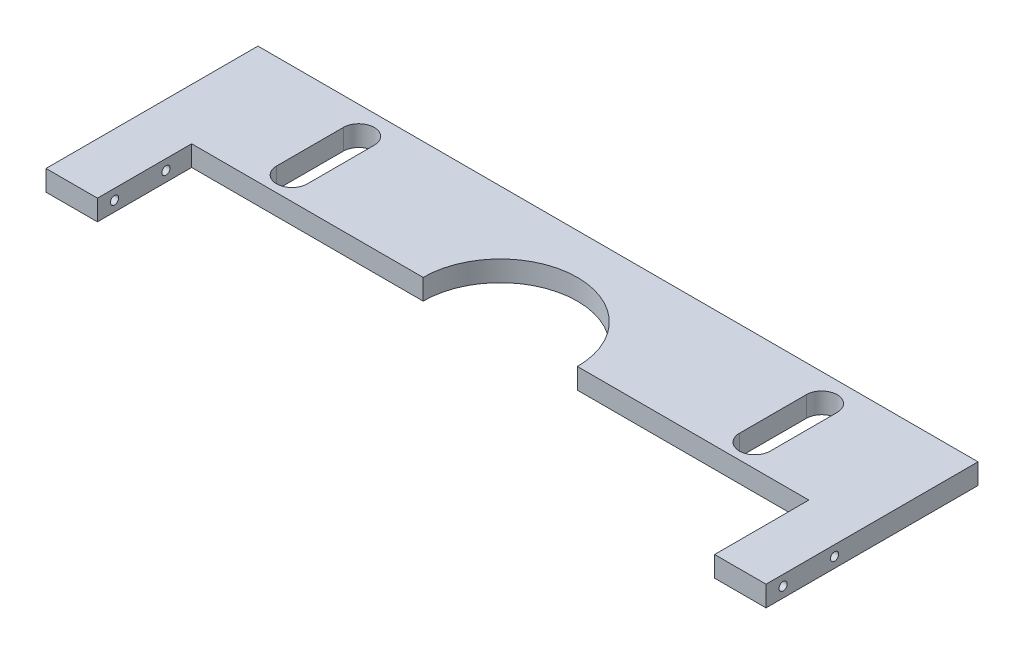
ISO-10303-21;
HEADER;
FILE_DESCRIPTION(('STEP AP214'),'2;1');
FILE_NAME('part.step','',(''),(''),'','','');
FILE_SCHEMA(('AUTOMOTIVE_DESIGN { 1 0 10303 214 1 1 1 1 }'));
ENDSEC;
DATA;
#1=APPLICATION_CONTEXT('core data for automotive mechanical design processes');
#2=APPLICATION_PROTOCOL_DEFINITION('international standard','automotive_design',2000,#1);
#3=PRODUCT_CONTEXT('',#1,'mechanical');
#4=PRODUCT('Part','Part','',(#3));
#5=PRODUCT_RELATED_PRODUCT_CATEGORY('part','',(#4));
#6=PRODUCT_DEFINITION_FORMATION('','',#4);
#7=PRODUCT_DEFINITION_CONTEXT('part definition',#1,'design');
#8=PRODUCT_DEFINITION('design','',#6,#7);
#9=PRODUCT_DEFINITION_SHAPE('','',#8);
#10=(LENGTH_UNIT() NAMED_UNIT(*) SI_UNIT(.MILLI.,.METRE.));
#11=(NAMED_UNIT(*) PLANE_ANGLE_UNIT() SI_UNIT($,.RADIAN.));
#12=(NAMED_UNIT(*) SI_UNIT($,.STERADIAN.) SOLID_ANGLE_UNIT());
#13=UNCERTAINTY_MEASURE_WITH_UNIT(LENGTH_MEASURE(1.E-05),#10,'distance_accuracy_value','');
#14=(GEOMETRIC_REPRESENTATION_CONTEXT(3) GLOBAL_UNCERTAINTY_ASSIGNED_CONTEXT((#13)) GLOBAL_UNIT_ASSIGNED_CONTEXT((#10,
#11,#12)) REPRESENTATION_CONTEXT('',''));
#15=CARTESIAN_POINT('',(0.,0.,0.));
#16=DIRECTION('',(0.,0.,1.));
#17=DIRECTION('',(1.,0.,0.));
#18=AXIS2_PLACEMENT_3D('',#15,#16,#17);
#19=CARTESIAN_POINT('',(-60.,0.,-0.555000000000003));
#20=DIRECTION('',(0.,0.,-1.));
#21=DIRECTION('',(-1.,0.,0.));
#22=AXIS2_PLACEMENT_3D('',#19,#20,#21);
#23=PLANE('',#22);
#24=DIRECTION('',(-1.,0.,0.));
#25=VECTOR('',#24,1.);
#26=CARTESIAN_POINT('',(-60.,0.,-0.555000000000003));
#27=LINE('',#26,#25);
#28=CARTESIAN_POINT('',(-15.,0.,-0.555000000000011));
#29=VERTEX_POINT('',#28);
#30=CARTESIAN_POINT('',(-60.,0.,-0.555000000000003));
#31=VERTEX_POINT('',#30);
#32=EDGE_CURVE('E171',#29,#31,#27,.T.);
#33=ORIENTED_EDGE('',*,*,#32,.F.);
#34=DIRECTION('',(0.,1.,0.));
#35=VECTOR('',#34,1.);
#36=CARTESIAN_POINT('',(-15.,-6.,-0.555000000000003));
#37=LINE('',#36,#35);
#38=CARTESIAN_POINT('',(-15.,4.,-0.555000000000011));
#39=VERTEX_POINT('',#38);
#40=EDGE_CURVE('E11',#29,#39,#37,.T.);
#41=ORIENTED_EDGE('',*,*,#40,.T.);
#42=DIRECTION('',(-1.,0.,0.));
#43=VECTOR('',#42,1.);
#44=CARTESIAN_POINT('',(-60.,4.,-0.555000000000003));
#45=LINE('',#44,#43);
#46=CARTESIAN_POINT('',(-60.,4.,-0.555000000000003));
#47=VERTEX_POINT('',#46);
#48=EDGE_CURVE('E169',#39,#47,#45,.T.);
#49=ORIENTED_EDGE('',*,*,#48,.T.);
#50=DIRECTION('',(0.,1.,0.));
#51=VECTOR('',#50,1.);
#52=CARTESIAN_POINT('',(-60.,0.,-0.555000000000003));
#53=LINE('',#52,#51);
#54=EDGE_CURVE('E184',#31,#47,#53,.T.);
#55=ORIENTED_EDGE('',*,*,#54,.F.);
#56=EDGE_LOOP('',(#33,#41,#49,#55));
#57=FACE_BOUND('',#56,.T.);
#58=ADVANCED_FACE('F36',(#57),#23,.F.);
#59=CARTESIAN_POINT('',(70.,4.,19.445));
#60=DIRECTION('',(-1.,0.,0.));
#61=DIRECTION('',(0.,0.,1.));
#62=AXIS2_PLACEMENT_3D('',#59,#60,#61);
#63=PLANE('',#62);
#64=CARTESIAN_POINT('',(70.,2.,4.445));
#65=DIRECTION('',(1.,0.,0.));
#66=DIRECTION('',(0.,0.,-1.));
#67=AXIS2_PLACEMENT_3D('',#64,#65,#66);
#68=CIRCLE('',#67,0.799999999999998);
#69=CARTESIAN_POINT('',(70.,2.,3.645));
#70=VERTEX_POINT('',#69);
#71=EDGE_CURVE('E198',#70,#70,#68,.T.);
#72=ORIENTED_EDGE('',*,*,#71,.F.);
#73=EDGE_LOOP('',(#72));
#74=FACE_BOUND('',#73,.T.);
#75=CARTESIAN_POINT('',(70.,2.,14.445));
#76=DIRECTION('',(1.,0.,0.));
#77=DIRECTION('',(0.,0.,-1.));
#78=AXIS2_PLACEMENT_3D('',#75,#76,#77);
#79=CIRCLE('',#78,0.799999999999998);
#80=CARTESIAN_POINT('',(70.,2.,13.645));
#81=VERTEX_POINT('',#80);
#82=EDGE_CURVE('E201',#81,#81,#79,.T.);
#83=ORIENTED_EDGE('',*,*,#82,.F.);
#84=EDGE_LOOP('',(#83));
#85=FACE_BOUND('',#84,.T.);
#86=DIRECTION('',(0.,0.,-1.));
#87=VECTOR('',#86,1.);
#88=CARTESIAN_POINT('',(70.,4.,19.445));
#89=LINE('',#88,#87);
#90=CARTESIAN_POINT('',(70.,4.,17.765));
#91=VERTEX_POINT('',#90);
#92=CARTESIAN_POINT('',(70.,4.,-23.445));
#93=VERTEX_POINT('',#92);
#94=EDGE_CURVE('E211',#91,#93,#89,.T.);
#95=ORIENTED_EDGE('',*,*,#94,.F.);
#96=DIRECTION('',(0.,1.,0.));
#97=VECTOR('',#96,1.);
#98=CARTESIAN_POINT('',(70.,-6.,17.765));
#99=LINE('',#98,#97);
#100=CARTESIAN_POINT('',(70.,0.,17.765));
#101=VERTEX_POINT('',#100);
#102=EDGE_CURVE('E280',#101,#91,#99,.T.);
#103=ORIENTED_EDGE('',*,*,#102,.F.);
#104=DIRECTION('',(0.,0.,-1.));
#105=VECTOR('',#104,1.);
#106=CARTESIAN_POINT('',(70.,0.,19.445));
#107=LINE('',#106,#105);
#108=CARTESIAN_POINT('',(70.,0.,-23.445));
#109=VERTEX_POINT('',#108);
#110=EDGE_CURVE('E210',#101,#109,#107,.T.);
#111=ORIENTED_EDGE('',*,*,#110,.T.);
#112=DIRECTION('',(0.,1.,0.));
#113=VECTOR('',#112,1.);
#114=CARTESIAN_POINT('',(70.,0.,-23.445));
#115=LINE('',#114,#113);
#116=EDGE_CURVE('E244',#109,#93,#115,.T.);
#117=ORIENTED_EDGE('',*,*,#116,.T.);
#118=EDGE_LOOP('',(#95,#103,#111,#117));
#119=FACE_BOUND('',#118,.T.);
#120=ADVANCED_FACE('F38',(#74,#85,#119),#63,.F.);
#121=CARTESIAN_POINT('',(-70.,4.,19.445));
#122=DIRECTION('',(1.,0.,0.));
#123=DIRECTION('',(0.,0.,-1.));
#124=AXIS2_PLACEMENT_3D('',#121,#122,#123);
#125=PLANE('',#124);
#126=CARTESIAN_POINT('',(-70.,2.,4.445));
#127=DIRECTION('',(-1.,0.,0.));
#128=DIRECTION('',(0.,0.,1.));
#129=AXIS2_PLACEMENT_3D('',#126,#127,#128);
#130=CIRCLE('',#129,0.799999999999998);
#131=CARTESIAN_POINT('',(-70.,2.,5.24499999999999));
#132=VERTEX_POINT('',#131);
#133=EDGE_CURVE('E204',#132,#132,#130,.T.);
#134=ORIENTED_EDGE('',*,*,#133,.F.);
#135=EDGE_LOOP('',(#134));
#136=FACE_BOUND('',#135,.T.);
#137=CARTESIAN_POINT('',(-70.,2.,14.445));
#138=DIRECTION('',(-1.,0.,0.));
#139=DIRECTION('',(0.,0.,1.));
#140=AXIS2_PLACEMENT_3D('',#137,#138,#139);
#141=CIRCLE('',#140,0.799999999999998);
#142=CARTESIAN_POINT('',(-70.,2.,15.245));
#143=VERTEX_POINT('',#142);
#144=EDGE_CURVE('E207',#143,#143,#141,.T.);
#145=ORIENTED_EDGE('',*,*,#144,.F.);
#146=EDGE_LOOP('',(#145));
#147=FACE_BOUND('',#146,.T.);
#148=DIRECTION('',(0.,0.,1.));
#149=VECTOR('',#148,1.);
#150=CARTESIAN_POINT('',(-70.,0.,19.445));
#151=LINE('',#150,#149);
#152=CARTESIAN_POINT('',(-70.,0.,-23.445));
#153=VERTEX_POINT('',#152);
#154=CARTESIAN_POINT('',(-70.,0.,17.765));
#155=VERTEX_POINT('',#154);
#156=EDGE_CURVE('E214',#153,#155,#151,.T.);
#157=ORIENTED_EDGE('',*,*,#156,.T.);
#158=DIRECTION('',(0.,1.,0.));
#159=VECTOR('',#158,1.);
#160=CARTESIAN_POINT('',(-70.,-6.,17.765));
#161=LINE('',#160,#159);
#162=CARTESIAN_POINT('',(-70.,4.,17.765));
#163=VERTEX_POINT('',#162);
#164=EDGE_CURVE('E268',#155,#163,#161,.T.);
#165=ORIENTED_EDGE('',*,*,#164,.T.);
#166=DIRECTION('',(0.,0.,1.));
#167=VECTOR('',#166,1.);
#168=CARTESIAN_POINT('',(-70.,4.,19.445));
#169=LINE('',#168,#167);
#170=CARTESIAN_POINT('',(-70.,4.,-23.445));
#171=VERTEX_POINT('',#170);
#172=EDGE_CURVE('E213',#171,#163,#169,.T.);
#173=ORIENTED_EDGE('',*,*,#172,.F.);
#174=DIRECTION('',(0.,1.,0.));
#175=VECTOR('',#174,1.);
#176=CARTESIAN_POINT('',(-70.,0.,-23.445));
#177=LINE('',#176,#175);
#178=EDGE_CURVE('E240',#153,#171,#177,.T.);
#179=ORIENTED_EDGE('',*,*,#178,.F.);
#180=EDGE_LOOP('',(#157,#165,#173,#179));
#181=FACE_BOUND('',#180,.T.);
#182=ADVANCED_FACE('F279',(#136,#147,#181),#125,.F.);
#183=CARTESIAN_POINT('',(0.,4.,0.));
#184=DIRECTION('',(0.,-1.,0.));
#185=DIRECTION('',(0.,0.,-1.));
#186=AXIS2_PLACEMENT_3D('',#183,#184,#185);
#187=PLANE('',#186);
#188=DIRECTION('',(0.,0.,1.));
#189=VECTOR('',#188,1.);
#190=CARTESIAN_POINT('',(42.,4.,-18.055));
#191=LINE('',#190,#189);
#192=CARTESIAN_POINT('',(42.,4.,-18.055));
#193=VERTEX_POINT('',#192);
#194=CARTESIAN_POINT('',(42.,4.,-5.055));
#195=VERTEX_POINT('',#194);
#196=EDGE_CURVE('E334',#193,#195,#191,.T.);
#197=ORIENTED_EDGE('',*,*,#196,.F.);
#198=CARTESIAN_POINT('',(45.,4.,-18.055));
#199=DIRECTION('',(0.,1.,0.));
#200=DIRECTION('',(0.,0.,1.));
#201=AXIS2_PLACEMENT_3D('',#198,#199,#200);
#202=CIRCLE('',#201,3.);
#203=CARTESIAN_POINT('',(48.,4.,-18.055));
#204=VERTEX_POINT('',#203);
#205=EDGE_CURVE('E59',#204,#193,#202,.T.);
#206=ORIENTED_EDGE('',*,*,#205,.F.);
#207=DIRECTION('',(0.,0.,-1.));
#208=VECTOR('',#207,1.);
#209=CARTESIAN_POINT('',(48.,4.,-18.055));
#210=LINE('',#209,#208);
#211=CARTESIAN_POINT('',(48.,4.,-5.055));
#212=VERTEX_POINT('',#211);
#213=EDGE_CURVE('E327',#212,#204,#210,.T.);
#214=ORIENTED_EDGE('',*,*,#213,.F.);
#215=CARTESIAN_POINT('',(45.,4.,-5.055));
#216=DIRECTION('',(0.,1.,0.));
#217=DIRECTION('',(0.,0.,1.));
#218=AXIS2_PLACEMENT_3D('',#215,#216,#217);
#219=CIRCLE('',#218,3.);
#220=EDGE_CURVE('E331',#195,#212,#219,.T.);
#221=ORIENTED_EDGE('',*,*,#220,.F.);
#222=EDGE_LOOP('',(#197,#206,#214,#221));
#223=FACE_BOUND('',#222,.T.);
#224=DIRECTION('',(0.,0.,1.));
#225=VECTOR('',#224,1.);
#226=CARTESIAN_POINT('',(-48.,4.,-18.055));
#227=LINE('',#226,#225);
#228=CARTESIAN_POINT('',(-48.,4.,-18.055));
#229=VERTEX_POINT('',#228);
#230=CARTESIAN_POINT('',(-48.,4.,-5.055));
#231=VERTEX_POINT('',#230);
#232=EDGE_CURVE('E303',#229,#231,#227,.T.);
#233=ORIENTED_EDGE('',*,*,#232,.F.);
#234=CARTESIAN_POINT('',(-45.,4.,-18.055));
#235=DIRECTION('',(0.,1.,0.));
#236=DIRECTION('',(0.,0.,1.));
#237=AXIS2_PLACEMENT_3D('',#234,#235,#236);
#238=CIRCLE('',#237,3.);
#239=CARTESIAN_POINT('',(-42.,4.,-18.055));
#240=VERTEX_POINT('',#239);
#241=EDGE_CURVE('E306',#240,#229,#238,.T.);
#242=ORIENTED_EDGE('',*,*,#241,.F.);
#243=DIRECTION('',(0.,0.,-1.));
#244=VECTOR('',#243,1.);
#245=CARTESIAN_POINT('',(-42.,4.,-18.055));
#246=LINE('',#245,#244);
#247=CARTESIAN_POINT('',(-42.,4.,-5.055));
#248=VERTEX_POINT('',#247);
#249=EDGE_CURVE('E296',#248,#240,#246,.T.);
#250=ORIENTED_EDGE('',*,*,#249,.F.);
#251=CARTESIAN_POINT('',(-45.,4.,-5.055));
#252=DIRECTION('',(0.,1.,0.));
#253=DIRECTION('',(0.,0.,1.));
#254=AXIS2_PLACEMENT_3D('',#251,#252,#253);
#255=CIRCLE('',#254,3.);
#256=EDGE_CURVE('E300',#231,#248,#255,.T.);
#257=ORIENTED_EDGE('',*,*,#256,.F.);
#258=EDGE_LOOP('',(#233,#242,#250,#257));
#259=FACE_BOUND('',#258,.T.);
#260=ORIENTED_EDGE('',*,*,#48,.F.);
#261=CARTESIAN_POINT('',(0.,4.,-0.555000000000003));
#262=DIRECTION('',(0.,1.,0.));
#263=DIRECTION('',(0.,0.,1.));
#264=AXIS2_PLACEMENT_3D('',#261,#262,#263);
#265=CIRCLE('',#264,15.);
#266=CARTESIAN_POINT('',(15.,4.,-0.555000000000011));
#267=VERTEX_POINT('',#266);
#268=EDGE_CURVE('E159',#267,#39,#265,.T.);
#269=ORIENTED_EDGE('',*,*,#268,.F.);
#270=CARTESIAN_POINT('',(60.,4.,-0.555000000000003));
#271=VERTEX_POINT('',#270);
#272=EDGE_CURVE('E177',#271,#267,#45,.T.);
#273=ORIENTED_EDGE('',*,*,#272,.F.);
#274=DIRECTION('',(0.,0.,-1.));
#275=VECTOR('',#274,1.);
#276=CARTESIAN_POINT('',(60.,4.,19.445));
#277=LINE('',#276,#275);
#278=CARTESIAN_POINT('',(60.,4.,17.765));
#279=VERTEX_POINT('',#278);
#280=EDGE_CURVE('E178',#279,#271,#277,.T.);
#281=ORIENTED_EDGE('',*,*,#280,.F.);
#282=DIRECTION('',(-1.,0.,0.));
#283=VECTOR('',#282,1.);
#284=CARTESIAN_POINT('',(-70.,4.,17.765));
#285=LINE('',#284,#283);
#286=EDGE_CURVE('E282',#91,#279,#285,.T.);
#287=ORIENTED_EDGE('',*,*,#286,.F.);
#288=ORIENTED_EDGE('',*,*,#94,.T.);
#289=DIRECTION('',(-1.,0.,0.));
#290=VECTOR('',#289,1.);
#291=CARTESIAN_POINT('',(-70.,4.,-23.445));
#292=LINE('',#291,#290);
#293=EDGE_CURVE('E255',#93,#171,#292,.T.);
#294=ORIENTED_EDGE('',*,*,#293,.T.);
#295=ORIENTED_EDGE('',*,*,#172,.T.);
#296=CARTESIAN_POINT('',(-60.,4.,17.765));
#297=VERTEX_POINT('',#296);
#298=EDGE_CURVE('E285',#297,#163,#285,.T.);
#299=ORIENTED_EDGE('',*,*,#298,.F.);
#300=DIRECTION('',(0.,0.,1.));
#301=VECTOR('',#300,1.);
#302=CARTESIAN_POINT('',(-60.,4.,19.445));
#303=LINE('',#302,#301);
#304=EDGE_CURVE('E176',#47,#297,#303,.T.);
#305=ORIENTED_EDGE('',*,*,#304,.F.);
#306=EDGE_LOOP('',(#260,#269,#273,#281,#287,#288,#294,#295,#299,#305));
#307=FACE_BOUND('',#306,.T.);
#308=ADVANCED_FACE('F173',(#223,#259,#307),#187,.F.);
#309=CARTESIAN_POINT('',(0.,0.,0.));
#310=DIRECTION('',(0.,-1.,0.));
#311=DIRECTION('',(0.,0.,-1.));
#312=AXIS2_PLACEMENT_3D('',#309,#310,#311);
#313=PLANE('',#312);
#314=CARTESIAN_POINT('',(0.,0.,-0.555000000000003));
#315=DIRECTION('',(0.,-1.,0.));
#316=DIRECTION('',(0.,0.,-1.));
#317=AXIS2_PLACEMENT_3D('',#314,#315,#316);
#318=CIRCLE('',#317,15.);
#319=CARTESIAN_POINT('',(15.,0.,-0.555000000000003));
#320=VERTEX_POINT('',#319);
#321=EDGE_CURVE('E51',#29,#320,#318,.T.);
#322=ORIENTED_EDGE('',*,*,#321,.F.);
#323=ORIENTED_EDGE('',*,*,#32,.T.);
#324=DIRECTION('',(0.,0.,1.));
#325=VECTOR('',#324,1.);
#326=CARTESIAN_POINT('',(-60.,0.,19.445));
#327=LINE('',#326,#325);
#328=CARTESIAN_POINT('',(-60.,0.,17.765));
#329=VERTEX_POINT('',#328);
#330=EDGE_CURVE('E180',#31,#329,#327,.T.);
#331=ORIENTED_EDGE('',*,*,#330,.T.);
#332=DIRECTION('',(1.,0.,0.));
#333=VECTOR('',#332,1.);
#334=CARTESIAN_POINT('',(0.,0.,17.765));
#335=LINE('',#334,#333);
#336=EDGE_CURVE('E260',#155,#329,#335,.T.);
#337=ORIENTED_EDGE('',*,*,#336,.F.);
#338=ORIENTED_EDGE('',*,*,#156,.F.);
#339=DIRECTION('',(-1.,0.,0.));
#340=VECTOR('',#339,1.);
#341=CARTESIAN_POINT('',(-70.,0.,-23.445));
#342=LINE('',#341,#340);
#343=EDGE_CURVE('E252',#109,#153,#342,.T.);
#344=ORIENTED_EDGE('',*,*,#343,.F.);
#345=ORIENTED_EDGE('',*,*,#110,.F.);
#346=CARTESIAN_POINT('',(60.,0.,17.765));
#347=VERTEX_POINT('',#346);
#348=EDGE_CURVE('E265',#347,#101,#335,.T.);
#349=ORIENTED_EDGE('',*,*,#348,.F.);
#350=DIRECTION('',(0.,0.,-1.));
#351=VECTOR('',#350,1.);
#352=CARTESIAN_POINT('',(60.,0.,19.445));
#353=LINE('',#352,#351);
#354=CARTESIAN_POINT('',(60.,0.,-0.555000000000003));
#355=VERTEX_POINT('',#354);
#356=EDGE_CURVE('E236',#347,#355,#353,.T.);
#357=ORIENTED_EDGE('',*,*,#356,.T.);
#358=EDGE_CURVE('E190',#355,#320,#27,.T.);
#359=ORIENTED_EDGE('',*,*,#358,.T.);
#360=EDGE_LOOP('',(#322,#323,#331,#337,#338,#344,#345,#349,#357,#359));
#361=FACE_BOUND('',#360,.T.);
#362=CARTESIAN_POINT('',(45.,0.,-18.055));
#363=DIRECTION('',(0.,1.,0.));
#364=DIRECTION('',(0.,0.,1.));
#365=AXIS2_PLACEMENT_3D('',#362,#363,#364);
#366=CIRCLE('',#365,3.);
#367=CARTESIAN_POINT('',(48.,0.,-18.055));
#368=VERTEX_POINT('',#367);
#369=CARTESIAN_POINT('',(42.,0.,-18.055));
#370=VERTEX_POINT('',#369);
#371=EDGE_CURVE('E330',#368,#370,#366,.T.);
#372=ORIENTED_EDGE('',*,*,#371,.T.);
#373=DIRECTION('',(0.,0.,1.));
#374=VECTOR('',#373,1.);
#375=CARTESIAN_POINT('',(42.,0.,-18.055));
#376=LINE('',#375,#374);
#377=CARTESIAN_POINT('',(42.,0.,-5.055));
#378=VERTEX_POINT('',#377);
#379=EDGE_CURVE('E343',#370,#378,#376,.T.);
#380=ORIENTED_EDGE('',*,*,#379,.T.);
#381=CARTESIAN_POINT('',(45.,0.,-5.055));
#382=DIRECTION('',(0.,1.,0.));
#383=DIRECTION('',(0.,0.,1.));
#384=AXIS2_PLACEMENT_3D('',#381,#382,#383);
#385=CIRCLE('',#384,3.);
#386=CARTESIAN_POINT('',(48.,0.,-5.055));
#387=VERTEX_POINT('',#386);
#388=EDGE_CURVE('E340',#378,#387,#385,.T.);
#389=ORIENTED_EDGE('',*,*,#388,.T.);
#390=DIRECTION('',(0.,0.,-1.));
#391=VECTOR('',#390,1.);
#392=CARTESIAN_POINT('',(48.,0.,-18.055));
#393=LINE('',#392,#391);
#394=EDGE_CURVE('E322',#387,#368,#393,.T.);
#395=ORIENTED_EDGE('',*,*,#394,.T.);
#396=EDGE_LOOP('',(#372,#380,#389,#395));
#397=FACE_BOUND('',#396,.T.);
#398=CARTESIAN_POINT('',(-45.,0.,-18.055));
#399=DIRECTION('',(0.,1.,0.));
#400=DIRECTION('',(0.,0.,1.));
#401=AXIS2_PLACEMENT_3D('',#398,#399,#400);
#402=CIRCLE('',#401,3.);
#403=CARTESIAN_POINT('',(-42.,0.,-18.055));
#404=VERTEX_POINT('',#403);
#405=CARTESIAN_POINT('',(-48.,0.,-18.055));
#406=VERTEX_POINT('',#405);
#407=EDGE_CURVE('E299',#404,#406,#402,.T.);
#408=ORIENTED_EDGE('',*,*,#407,.T.);
#409=DIRECTION('',(0.,0.,1.));
#410=VECTOR('',#409,1.);
#411=CARTESIAN_POINT('',(-48.,0.,-18.055));
#412=LINE('',#411,#410);
#413=CARTESIAN_POINT('',(-48.,0.,-5.055));
#414=VERTEX_POINT('',#413);
#415=EDGE_CURVE('E314',#406,#414,#412,.T.);
#416=ORIENTED_EDGE('',*,*,#415,.T.);
#417=CARTESIAN_POINT('',(-45.,0.,-5.055));
#418=DIRECTION('',(0.,1.,0.));
#419=DIRECTION('',(0.,0.,1.));
#420=AXIS2_PLACEMENT_3D('',#417,#418,#419);
#421=CIRCLE('',#420,3.);
#422=CARTESIAN_POINT('',(-42.,0.,-5.055));
#423=VERTEX_POINT('',#422);
#424=EDGE_CURVE('E311',#414,#423,#421,.T.);
#425=ORIENTED_EDGE('',*,*,#424,.T.);
#426=DIRECTION('',(0.,0.,-1.));
#427=VECTOR('',#426,1.);
#428=CARTESIAN_POINT('',(-42.,0.,-18.055));
#429=LINE('',#428,#427);
#430=EDGE_CURVE('E290',#423,#404,#429,.T.);
#431=ORIENTED_EDGE('',*,*,#430,.T.);
#432=EDGE_LOOP('',(#408,#416,#425,#431));
#433=FACE_BOUND('',#432,.T.);
#434=ADVANCED_FACE('F232',(#361,#397,#433),#313,.T.);
#435=CARTESIAN_POINT('',(-70.,2.,14.445));
#436=DIRECTION('',(-1.,0.,0.));
#437=DIRECTION('',(0.,0.,1.));
#438=AXIS2_PLACEMENT_3D('',#435,#436,#437);
#439=CYLINDRICAL_SURFACE('',#438,0.799999999999997);
#440=CARTESIAN_POINT('',(-60.,2.,14.445));
#441=DIRECTION('',(-1.,0.,0.));
#442=DIRECTION('',(0.,0.,1.));
#443=AXIS2_PLACEMENT_3D('',#440,#441,#442);
#444=CIRCLE('',#443,0.799999999999997);
#445=CARTESIAN_POINT('',(-60.,2.,15.245));
#446=VERTEX_POINT('',#445);
#447=EDGE_CURVE('E195',#446,#446,#444,.F.);
#448=ORIENTED_EDGE('',*,*,#447,.T.);
#449=EDGE_LOOP('',(#448));
#450=FACE_BOUND('',#449,.T.);
#451=ORIENTED_EDGE('',*,*,#144,.T.);
#452=EDGE_LOOP('',(#451));
#453=FACE_BOUND('',#452,.T.);
#454=ADVANCED_FACE('F384',(#450,#453),#439,.F.);
#455=CARTESIAN_POINT('',(-70.,2.,4.445));
#456=DIRECTION('',(-1.,0.,0.));
#457=DIRECTION('',(0.,0.,1.));
#458=AXIS2_PLACEMENT_3D('',#455,#456,#457);
#459=CYLINDRICAL_SURFACE('',#458,0.799999999999997);
#460=CARTESIAN_POINT('',(-60.,2.,4.445));
#461=DIRECTION('',(-1.,0.,0.));
#462=DIRECTION('',(0.,0.,1.));
#463=AXIS2_PLACEMENT_3D('',#460,#461,#462);
#464=CIRCLE('',#463,0.799999999999997);
#465=CARTESIAN_POINT('',(-60.,2.,5.24499999999999));
#466=VERTEX_POINT('',#465);
#467=EDGE_CURVE('E194',#466,#466,#464,.F.);
#468=ORIENTED_EDGE('',*,*,#467,.T.);
#469=EDGE_LOOP('',(#468));
#470=FACE_BOUND('',#469,.T.);
#471=ORIENTED_EDGE('',*,*,#133,.T.);
#472=EDGE_LOOP('',(#471));
#473=FACE_BOUND('',#472,.T.);
#474=ADVANCED_FACE('F389',(#470,#473),#459,.F.);
#475=CARTESIAN_POINT('',(70.,2.,14.445));
#476=DIRECTION('',(1.,0.,0.));
#477=DIRECTION('',(0.,0.,-1.));
#478=AXIS2_PLACEMENT_3D('',#475,#476,#477);
#479=CYLINDRICAL_SURFACE('',#478,0.799999999999997);
#480=CARTESIAN_POINT('',(60.,2.,14.445));
#481=DIRECTION('',(1.,0.,0.));
#482=DIRECTION('',(0.,0.,-1.));
#483=AXIS2_PLACEMENT_3D('',#480,#481,#482);
#484=CIRCLE('',#483,0.799999999999997);
#485=CARTESIAN_POINT('',(60.,2.,13.645));
#486=VERTEX_POINT('',#485);
#487=EDGE_CURVE('E191',#486,#486,#484,.F.);
#488=ORIENTED_EDGE('',*,*,#487,.T.);
#489=EDGE_LOOP('',(#488));
#490=FACE_BOUND('',#489,.T.);
#491=ORIENTED_EDGE('',*,*,#82,.T.);
#492=EDGE_LOOP('',(#491));
#493=FACE_BOUND('',#492,.T.);
#494=ADVANCED_FACE('F419',(#490,#493),#479,.F.);
#495=CARTESIAN_POINT('',(70.,2.,4.445));
#496=DIRECTION('',(1.,0.,0.));
#497=DIRECTION('',(0.,0.,-1.));
#498=AXIS2_PLACEMENT_3D('',#495,#496,#497);
#499=CYLINDRICAL_SURFACE('',#498,0.799999999999997);
#500=CARTESIAN_POINT('',(60.,2.,4.445));
#501=DIRECTION('',(1.,0.,0.));
#502=DIRECTION('',(0.,0.,-1.));
#503=AXIS2_PLACEMENT_3D('',#500,#501,#502);
#504=CIRCLE('',#503,0.799999999999997);
#505=CARTESIAN_POINT('',(60.,2.,3.645));
#506=VERTEX_POINT('',#505);
#507=EDGE_CURVE('E186',#506,#506,#504,.F.);
#508=ORIENTED_EDGE('',*,*,#507,.T.);
#509=EDGE_LOOP('',(#508));
#510=FACE_BOUND('',#509,.T.);
#511=ORIENTED_EDGE('',*,*,#71,.T.);
#512=EDGE_LOOP('',(#511));
#513=FACE_BOUND('',#512,.T.);
#514=ADVANCED_FACE('F411',(#510,#513),#499,.F.);
#515=CARTESIAN_POINT('',(-60.,0.,19.445));
#516=DIRECTION('',(-1.,0.,0.));
#517=DIRECTION('',(0.,0.,1.));
#518=AXIS2_PLACEMENT_3D('',#515,#516,#517);
#519=PLANE('',#518);
#520=ORIENTED_EDGE('',*,*,#467,.F.);
#521=EDGE_LOOP('',(#520));
#522=FACE_BOUND('',#521,.T.);
#523=ORIENTED_EDGE('',*,*,#304,.T.);
#524=DIRECTION('',(0.,-1.,0.));
#525=VECTOR('',#524,1.);
#526=CARTESIAN_POINT('',(-60.,0.,17.765));
#527=LINE('',#526,#525);
#528=EDGE_CURVE('E263',#297,#329,#527,.T.);
#529=ORIENTED_EDGE('',*,*,#528,.T.);
#530=ORIENTED_EDGE('',*,*,#330,.F.);
#531=ORIENTED_EDGE('',*,*,#54,.T.);
#532=EDGE_LOOP('',(#523,#529,#530,#531));
#533=FACE_BOUND('',#532,.T.);
#534=ORIENTED_EDGE('',*,*,#447,.F.);
#535=EDGE_LOOP('',(#534));
#536=FACE_BOUND('',#535,.T.);
#537=ADVANCED_FACE('F261',(#522,#533,#536),#519,.F.);
#538=CARTESIAN_POINT('',(60.,0.,19.445));
#539=DIRECTION('',(1.,0.,0.));
#540=DIRECTION('',(0.,0.,-1.));
#541=AXIS2_PLACEMENT_3D('',#538,#539,#540);
#542=PLANE('',#541);
#543=ORIENTED_EDGE('',*,*,#507,.F.);
#544=EDGE_LOOP('',(#543));
#545=FACE_BOUND('',#544,.T.);
#546=ORIENTED_EDGE('',*,*,#356,.F.);
#547=DIRECTION('',(0.,1.,0.));
#548=VECTOR('',#547,1.);
#549=CARTESIAN_POINT('',(60.,0.,17.765));
#550=LINE('',#549,#548);
#551=EDGE_CURVE('E217',#347,#279,#550,.T.);
#552=ORIENTED_EDGE('',*,*,#551,.T.);
#553=ORIENTED_EDGE('',*,*,#280,.T.);
#554=DIRECTION('',(0.,1.,0.));
#555=VECTOR('',#554,1.);
#556=CARTESIAN_POINT('',(60.,0.,-0.555000000000003));
#557=LINE('',#556,#555);
#558=EDGE_CURVE('E187',#355,#271,#557,.T.);
#559=ORIENTED_EDGE('',*,*,#558,.F.);
#560=EDGE_LOOP('',(#546,#552,#553,#559));
#561=FACE_BOUND('',#560,.T.);
#562=ORIENTED_EDGE('',*,*,#487,.F.);
#563=EDGE_LOOP('',(#562));
#564=FACE_BOUND('',#563,.T.);
#565=ADVANCED_FACE('F401',(#545,#561,#564),#542,.F.);
#566=ORIENTED_EDGE('',*,*,#272,.T.);
#567=DIRECTION('',(0.,1.,0.));
#568=VECTOR('',#567,1.);
#569=CARTESIAN_POINT('',(15.,-6.,-0.555000000000003));
#570=LINE('',#569,#568);
#571=EDGE_CURVE('E44',#267,#320,#570,.F.);
#572=ORIENTED_EDGE('',*,*,#571,.T.);
#573=ORIENTED_EDGE('',*,*,#358,.F.);
#574=ORIENTED_EDGE('',*,*,#558,.T.);
#575=EDGE_LOOP('',(#566,#572,#573,#574));
#576=FACE_BOUND('',#575,.T.);
#577=ADVANCED_FACE('F229',(#576),#23,.F.);
#578=CARTESIAN_POINT('',(-70.,0.,-23.445));
#579=DIRECTION('',(0.,0.,-1.));
#580=DIRECTION('',(-1.,0.,0.));
#581=AXIS2_PLACEMENT_3D('',#578,#579,#580);
#582=PLANE('',#581);
#583=ORIENTED_EDGE('',*,*,#293,.F.);
#584=ORIENTED_EDGE('',*,*,#116,.F.);
#585=ORIENTED_EDGE('',*,*,#343,.T.);
#586=ORIENTED_EDGE('',*,*,#178,.T.);
#587=EDGE_LOOP('',(#583,#584,#585,#586));
#588=FACE_BOUND('',#587,.T.);
#589=ADVANCED_FACE('F274',(#588),#582,.T.);
#590=CARTESIAN_POINT('',(-70.,-6.,17.765));
#591=DIRECTION('',(0.,0.,-1.));
#592=DIRECTION('',(-1.,0.,0.));
#593=AXIS2_PLACEMENT_3D('',#590,#591,#592);
#594=PLANE('',#593);
#595=ORIENTED_EDGE('',*,*,#348,.T.);
#596=ORIENTED_EDGE('',*,*,#102,.T.);
#597=ORIENTED_EDGE('',*,*,#286,.T.);
#598=ORIENTED_EDGE('',*,*,#551,.F.);
#599=EDGE_LOOP('',(#595,#596,#597,#598));
#600=FACE_BOUND('',#599,.T.);
#601=ADVANCED_FACE('F406',(#600),#594,.F.);
#602=ORIENTED_EDGE('',*,*,#336,.T.);
#603=ORIENTED_EDGE('',*,*,#528,.F.);
#604=ORIENTED_EDGE('',*,*,#298,.T.);
#605=ORIENTED_EDGE('',*,*,#164,.F.);
#606=EDGE_LOOP('',(#602,#603,#604,#605));
#607=FACE_BOUND('',#606,.T.);
#608=ADVANCED_FACE('F518',(#607),#594,.F.);
#609=CARTESIAN_POINT('',(-45.,0.,-18.055));
#610=DIRECTION('',(0.,1.,0.));
#611=DIRECTION('',(0.,0.,1.));
#612=AXIS2_PLACEMENT_3D('',#609,#610,#611);
#613=CYLINDRICAL_SURFACE('',#612,3.);
#614=ORIENTED_EDGE('',*,*,#241,.T.);
#615=DIRECTION('',(0.,1.,0.));
#616=VECTOR('',#615,1.);
#617=CARTESIAN_POINT('',(-48.,0.,-18.055));
#618=LINE('',#617,#616);
#619=EDGE_CURVE('E286',#406,#229,#618,.T.);
#620=ORIENTED_EDGE('',*,*,#619,.F.);
#621=ORIENTED_EDGE('',*,*,#407,.F.);
#622=DIRECTION('',(0.,1.,0.));
#623=VECTOR('',#622,1.);
#624=CARTESIAN_POINT('',(-42.,0.,-18.055));
#625=LINE('',#624,#623);
#626=EDGE_CURVE('E294',#404,#240,#625,.T.);
#627=ORIENTED_EDGE('',*,*,#626,.T.);
#628=EDGE_LOOP('',(#614,#620,#621,#627));
#629=FACE_BOUND('',#628,.T.);
#630=ADVANCED_FACE('F377',(#629),#613,.F.);
#631=CARTESIAN_POINT('',(-42.,0.,-18.055));
#632=DIRECTION('',(1.,0.,0.));
#633=DIRECTION('',(0.,0.,-1.));
#634=AXIS2_PLACEMENT_3D('',#631,#632,#633);
#635=PLANE('',#634);
#636=ORIENTED_EDGE('',*,*,#249,.T.);
#637=ORIENTED_EDGE('',*,*,#626,.F.);
#638=ORIENTED_EDGE('',*,*,#430,.F.);
#639=DIRECTION('',(0.,1.,0.));
#640=VECTOR('',#639,1.);
#641=CARTESIAN_POINT('',(-42.,0.,-5.055));
#642=LINE('',#641,#640);
#643=EDGE_CURVE('E292',#423,#248,#642,.T.);
#644=ORIENTED_EDGE('',*,*,#643,.T.);
#645=EDGE_LOOP('',(#636,#637,#638,#644));
#646=FACE_BOUND('',#645,.T.);
#647=ADVANCED_FACE('F380',(#646),#635,.F.);
#648=CARTESIAN_POINT('',(-45.,0.,-5.055));
#649=DIRECTION('',(0.,1.,0.));
#650=DIRECTION('',(0.,0.,1.));
#651=AXIS2_PLACEMENT_3D('',#648,#649,#650);
#652=CYLINDRICAL_SURFACE('',#651,3.);
#653=ORIENTED_EDGE('',*,*,#256,.T.);
#654=ORIENTED_EDGE('',*,*,#643,.F.);
#655=ORIENTED_EDGE('',*,*,#424,.F.);
#656=DIRECTION('',(0.,1.,0.));
#657=VECTOR('',#656,1.);
#658=CARTESIAN_POINT('',(-48.,0.,-5.055));
#659=LINE('',#658,#657);
#660=EDGE_CURVE('E289',#414,#231,#659,.T.);
#661=ORIENTED_EDGE('',*,*,#660,.T.);
#662=EDGE_LOOP('',(#653,#654,#655,#661));
#663=FACE_BOUND('',#662,.T.);
#664=ADVANCED_FACE('F382',(#663),#652,.F.);
#665=CARTESIAN_POINT('',(-48.,0.,-18.055));
#666=DIRECTION('',(-1.,0.,0.));
#667=DIRECTION('',(0.,0.,1.));
#668=AXIS2_PLACEMENT_3D('',#665,#666,#667);
#669=PLANE('',#668);
#670=ORIENTED_EDGE('',*,*,#232,.T.);
#671=ORIENTED_EDGE('',*,*,#660,.F.);
#672=ORIENTED_EDGE('',*,*,#415,.F.);
#673=ORIENTED_EDGE('',*,*,#619,.T.);
#674=EDGE_LOOP('',(#670,#671,#672,#673));
#675=FACE_BOUND('',#674,.T.);
#676=ADVANCED_FACE('F373',(#675),#669,.F.);
#677=CARTESIAN_POINT('',(45.,0.,-18.055));
#678=DIRECTION('',(0.,1.,0.));
#679=DIRECTION('',(0.,0.,1.));
#680=AXIS2_PLACEMENT_3D('',#677,#678,#679);
#681=CYLINDRICAL_SURFACE('',#680,3.);
#682=ORIENTED_EDGE('',*,*,#205,.T.);
#683=DIRECTION('',(0.,1.,0.));
#684=VECTOR('',#683,1.);
#685=CARTESIAN_POINT('',(42.,0.,-18.055));
#686=LINE('',#685,#684);
#687=EDGE_CURVE('E319',#370,#193,#686,.T.);
#688=ORIENTED_EDGE('',*,*,#687,.F.);
#689=ORIENTED_EDGE('',*,*,#371,.F.);
#690=DIRECTION('',(0.,1.,0.));
#691=VECTOR('',#690,1.);
#692=CARTESIAN_POINT('',(48.,0.,-18.055));
#693=LINE('',#692,#691);
#694=EDGE_CURVE('E308',#368,#204,#693,.T.);
#695=ORIENTED_EDGE('',*,*,#694,.T.);
#696=EDGE_LOOP('',(#682,#688,#689,#695));
#697=FACE_BOUND('',#696,.T.);
#698=ADVANCED_FACE('F352',(#697),#681,.F.);
#699=CARTESIAN_POINT('',(48.,0.,-18.055));
#700=DIRECTION('',(1.,0.,0.));
#701=DIRECTION('',(0.,0.,-1.));
#702=AXIS2_PLACEMENT_3D('',#699,#700,#701);
#703=PLANE('',#702);
#704=ORIENTED_EDGE('',*,*,#213,.T.);
#705=ORIENTED_EDGE('',*,*,#694,.F.);
#706=ORIENTED_EDGE('',*,*,#394,.F.);
#707=DIRECTION('',(0.,1.,0.));
#708=VECTOR('',#707,1.);
#709=CARTESIAN_POINT('',(48.,0.,-5.055));
#710=LINE('',#709,#708);
#711=EDGE_CURVE('E324',#387,#212,#710,.T.);
#712=ORIENTED_EDGE('',*,*,#711,.T.);
#713=EDGE_LOOP('',(#704,#705,#706,#712));
#714=FACE_BOUND('',#713,.T.);
#715=ADVANCED_FACE('F362',(#714),#703,.F.);
#716=CARTESIAN_POINT('',(45.,0.,-5.055));
#717=DIRECTION('',(0.,1.,0.));
#718=DIRECTION('',(0.,0.,1.));
#719=AXIS2_PLACEMENT_3D('',#716,#717,#718);
#720=CYLINDRICAL_SURFACE('',#719,3.);
#721=ORIENTED_EDGE('',*,*,#220,.T.);
#722=ORIENTED_EDGE('',*,*,#711,.F.);
#723=ORIENTED_EDGE('',*,*,#388,.F.);
#724=DIRECTION('',(0.,1.,0.));
#725=VECTOR('',#724,1.);
#726=CARTESIAN_POINT('',(42.,0.,-5.055));
#727=LINE('',#726,#725);
#728=EDGE_CURVE('E321',#378,#195,#727,.T.);
#729=ORIENTED_EDGE('',*,*,#728,.T.);
#730=EDGE_LOOP('',(#721,#722,#723,#729));
#731=FACE_BOUND('',#730,.T.);
#732=ADVANCED_FACE('F359',(#731),#720,.F.);
#733=CARTESIAN_POINT('',(42.,0.,-18.055));
#734=DIRECTION('',(-1.,0.,0.));
#735=DIRECTION('',(0.,0.,1.));
#736=AXIS2_PLACEMENT_3D('',#733,#734,#735);
#737=PLANE('',#736);
#738=ORIENTED_EDGE('',*,*,#196,.T.);
#739=ORIENTED_EDGE('',*,*,#728,.F.);
#740=ORIENTED_EDGE('',*,*,#379,.F.);
#741=ORIENTED_EDGE('',*,*,#687,.T.);
#742=EDGE_LOOP('',(#738,#739,#740,#741));
#743=FACE_BOUND('',#742,.T.);
#744=ADVANCED_FACE('F356',(#743),#737,.F.);
#745=CARTESIAN_POINT('',(0.,-6.,-0.555000000000003));
#746=DIRECTION('',(0.,1.,0.));
#747=DIRECTION('',(0.,0.,1.));
#748=AXIS2_PLACEMENT_3D('',#745,#746,#747);
#749=CYLINDRICAL_SURFACE('',#748,15.);
#750=ORIENTED_EDGE('',*,*,#321,.T.);
#751=ORIENTED_EDGE('',*,*,#571,.F.);
#752=ORIENTED_EDGE('',*,*,#268,.T.);
#753=ORIENTED_EDGE('',*,*,#40,.F.);
#754=EDGE_LOOP('',(#750,#751,#752,#753));
#755=FACE_BOUND('',#754,.T.);
#756=ADVANCED_FACE('F160',(#755),#749,.F.);
#757=CLOSED_SHELL('',(#58,#120,#182,#308,#434,#454,#474,#494,#514,#537,#565,#577,#589,#601,#608,
#630,#647,#664,#676,#698,#715,#732,#744,#756));
#758=MANIFOLD_SOLID_BREP('B2',#757);
#759=ADVANCED_BREP_SHAPE_REPRESENTATION('',(#18,#758),#14);
#760=SHAPE_DEFINITION_REPRESENTATION(#9,#759);
ENDSEC;
END-ISO-10303-21;
